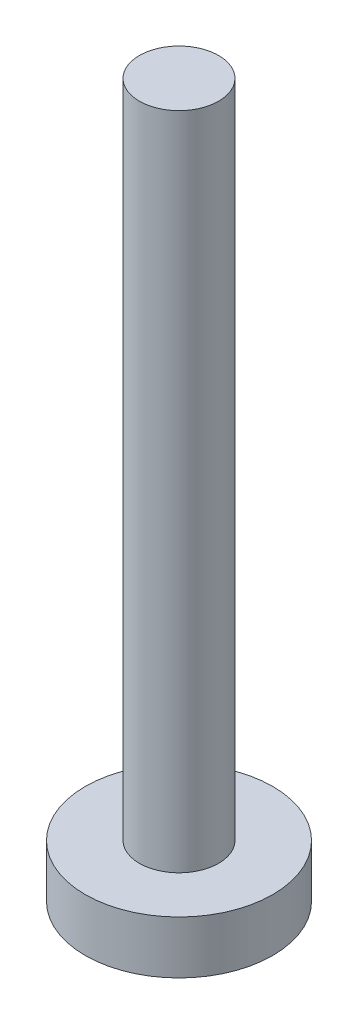
ISO-10303-21;
HEADER;
FILE_DESCRIPTION(('STEP AP214'),'2;1');
FILE_NAME('part.step','',(''),(''),'','','');
FILE_SCHEMA(('AUTOMOTIVE_DESIGN { 1 0 10303 214 1 1 1 1 }'));
ENDSEC;
DATA;
#1=APPLICATION_CONTEXT('core data for automotive mechanical design processes');
#2=APPLICATION_PROTOCOL_DEFINITION('international standard','automotive_design',2000,#1);
#3=PRODUCT_CONTEXT('',#1,'mechanical');
#4=PRODUCT('Part','Part','',(#3));
#5=PRODUCT_RELATED_PRODUCT_CATEGORY('part','',(#4));
#6=PRODUCT_DEFINITION_FORMATION('','',#4);
#7=PRODUCT_DEFINITION_CONTEXT('part definition',#1,'design');
#8=PRODUCT_DEFINITION('design','',#6,#7);
#9=PRODUCT_DEFINITION_SHAPE('','',#8);
#10=(LENGTH_UNIT() NAMED_UNIT(*) SI_UNIT(.MILLI.,.METRE.));
#11=(NAMED_UNIT(*) PLANE_ANGLE_UNIT() SI_UNIT($,.RADIAN.));
#12=(NAMED_UNIT(*) SI_UNIT($,.STERADIAN.) SOLID_ANGLE_UNIT());
#13=UNCERTAINTY_MEASURE_WITH_UNIT(LENGTH_MEASURE(1.E-05),#10,'distance_accuracy_value','');
#14=(GEOMETRIC_REPRESENTATION_CONTEXT(3) GLOBAL_UNCERTAINTY_ASSIGNED_CONTEXT((#13)) GLOBAL_UNIT_ASSIGNED_CONTEXT((#10,
#11,#12)) REPRESENTATION_CONTEXT('',''));
#15=CARTESIAN_POINT('',(0.,0.,0.));
#16=DIRECTION('',(0.,0.,1.));
#17=DIRECTION('',(1.,0.,0.));
#18=AXIS2_PLACEMENT_3D('',#15,#16,#17);
#19=CARTESIAN_POINT('',(0.,2.,0.));
#20=DIRECTION('',(0.,-1.,0.));
#21=DIRECTION('',(0.,0.,-1.));
#22=AXIS2_PLACEMENT_3D('',#19,#20,#21);
#23=CYLINDRICAL_SURFACE('',#22,3.55);
#24=CARTESIAN_POINT('',(0.,2.,0.));
#25=DIRECTION('',(0.,1.,0.));
#26=DIRECTION('',(0.,0.,1.));
#27=AXIS2_PLACEMENT_3D('',#24,#25,#26);
#28=CIRCLE('',#27,3.55);
#29=CARTESIAN_POINT('',(0.,2.,3.55));
#30=VERTEX_POINT('',#29);
#31=EDGE_CURVE('E10',#30,#30,#28,.T.);
#32=ORIENTED_EDGE('',*,*,#31,.F.);
#33=EDGE_LOOP('',(#32));
#34=FACE_BOUND('',#33,.T.);
#35=CARTESIAN_POINT('',(0.,0.,0.));
#36=DIRECTION('',(0.,1.,0.));
#37=DIRECTION('',(0.,0.,1.));
#38=AXIS2_PLACEMENT_3D('',#35,#36,#37);
#39=CIRCLE('',#38,3.55);
#40=CARTESIAN_POINT('',(0.,0.,3.55));
#41=VERTEX_POINT('',#40);
#42=EDGE_CURVE('E38',#41,#41,#39,.T.);
#43=ORIENTED_EDGE('',*,*,#42,.T.);
#44=EDGE_LOOP('',(#43));
#45=FACE_BOUND('',#44,.T.);
#46=ADVANCED_FACE('F35',(#34,#45),#23,.T.);
#47=CARTESIAN_POINT('',(0.,2.,0.));
#48=DIRECTION('',(0.,1.,0.));
#49=DIRECTION('',(0.,0.,1.));
#50=AXIS2_PLACEMENT_3D('',#47,#48,#49);
#51=PLANE('',#50);
#52=CARTESIAN_POINT('',(0.,2.,0.));
#53=DIRECTION('',(0.,1.,0.));
#54=DIRECTION('',(0.,0.,1.));
#55=AXIS2_PLACEMENT_3D('',#52,#53,#54);
#56=CIRCLE('',#55,1.5);
#57=CARTESIAN_POINT('',(0.,2.,1.5));
#58=VERTEX_POINT('',#57);
#59=EDGE_CURVE('E47',#58,#58,#56,.T.);
#60=ORIENTED_EDGE('',*,*,#59,.F.);
#61=EDGE_LOOP('',(#60));
#62=FACE_BOUND('',#61,.T.);
#63=ORIENTED_EDGE('',*,*,#31,.T.);
#64=EDGE_LOOP('',(#63));
#65=FACE_BOUND('',#64,.T.);
#66=ADVANCED_FACE('F62',(#62,#65),#51,.T.);
#67=CARTESIAN_POINT('',(0.,0.,0.));
#68=DIRECTION('',(0.,1.,0.));
#69=DIRECTION('',(0.,0.,1.));
#70=AXIS2_PLACEMENT_3D('',#67,#68,#69);
#71=PLANE('',#70);
#72=ORIENTED_EDGE('',*,*,#42,.F.);
#73=EDGE_LOOP('',(#72));
#74=FACE_BOUND('',#73,.T.);
#75=ADVANCED_FACE('F58',(#74),#71,.F.);
#76=CARTESIAN_POINT('',(0.,27.,0.));
#77=DIRECTION('',(0.,-1.,0.));
#78=DIRECTION('',(0.,0.,-1.));
#79=AXIS2_PLACEMENT_3D('',#76,#77,#78);
#80=CYLINDRICAL_SURFACE('',#79,1.5);
#81=CARTESIAN_POINT('',(0.,27.,0.));
#82=DIRECTION('',(0.,1.,0.));
#83=DIRECTION('',(0.,0.,1.));
#84=AXIS2_PLACEMENT_3D('',#81,#82,#83);
#85=CIRCLE('',#84,1.5);
#86=CARTESIAN_POINT('',(0.,27.,1.5));
#87=VERTEX_POINT('',#86);
#88=EDGE_CURVE('E45',#87,#87,#85,.T.);
#89=ORIENTED_EDGE('',*,*,#88,.F.);
#90=EDGE_LOOP('',(#89));
#91=FACE_BOUND('',#90,.T.);
#92=ORIENTED_EDGE('',*,*,#59,.T.);
#93=EDGE_LOOP('',(#92));
#94=FACE_BOUND('',#93,.T.);
#95=ADVANCED_FACE('F55',(#91,#94),#80,.T.);
#96=CARTESIAN_POINT('',(0.,27.,0.));
#97=DIRECTION('',(0.,1.,0.));
#98=DIRECTION('',(0.,0.,1.));
#99=AXIS2_PLACEMENT_3D('',#96,#97,#98);
#100=PLANE('',#99);
#101=ORIENTED_EDGE('',*,*,#88,.T.);
#102=EDGE_LOOP('',(#101));
#103=FACE_BOUND('',#102,.T.);
#104=ADVANCED_FACE('F53',(#103),#100,.T.);
#105=CLOSED_SHELL('',(#46,#66,#75,#95,#104));
#106=MANIFOLD_SOLID_BREP('B2',#105);
#107=ADVANCED_BREP_SHAPE_REPRESENTATION('',(#18,#106),#14);
#108=SHAPE_DEFINITION_REPRESENTATION(#9,#107);
ENDSEC;
END-ISO-10303-21;
